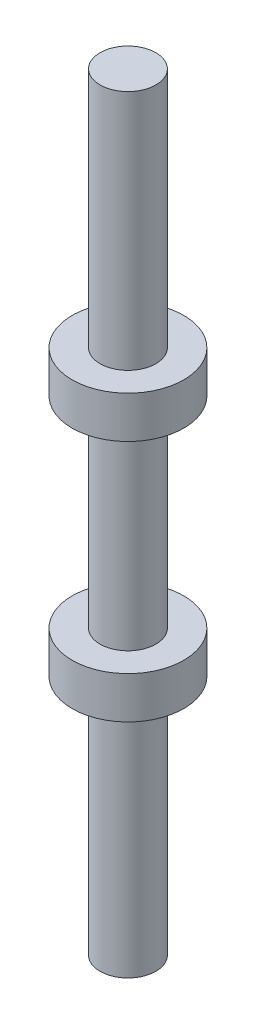
ISO-10303-21;
HEADER;
FILE_DESCRIPTION(('STEP AP214'),'2;1');
FILE_NAME('part.step','',(''),(''),'','','');
FILE_SCHEMA(('AUTOMOTIVE_DESIGN { 1 0 10303 214 1 1 1 1 }'));
ENDSEC;
DATA;
#1=APPLICATION_CONTEXT('core data for automotive mechanical design processes');
#2=APPLICATION_PROTOCOL_DEFINITION('international standard','automotive_design',2000,#1);
#3=PRODUCT_CONTEXT('',#1,'mechanical');
#4=PRODUCT('Part','Part','',(#3));
#5=PRODUCT_RELATED_PRODUCT_CATEGORY('part','',(#4));
#6=PRODUCT_DEFINITION_FORMATION('','',#4);
#7=PRODUCT_DEFINITION_CONTEXT('part definition',#1,'design');
#8=PRODUCT_DEFINITION('design','',#6,#7);
#9=PRODUCT_DEFINITION_SHAPE('','',#8);
#10=(LENGTH_UNIT() NAMED_UNIT(*) SI_UNIT(.MILLI.,.METRE.));
#11=(NAMED_UNIT(*) PLANE_ANGLE_UNIT() SI_UNIT($,.RADIAN.));
#12=(NAMED_UNIT(*) SI_UNIT($,.STERADIAN.) SOLID_ANGLE_UNIT());
#13=UNCERTAINTY_MEASURE_WITH_UNIT(LENGTH_MEASURE(1.E-05),#10,'distance_accuracy_value','');
#14=(GEOMETRIC_REPRESENTATION_CONTEXT(3) GLOBAL_UNCERTAINTY_ASSIGNED_CONTEXT((#13)) GLOBAL_UNIT_ASSIGNED_CONTEXT((#10,
#11,#12)) REPRESENTATION_CONTEXT('',''));
#15=CARTESIAN_POINT('',(0.,0.,0.));
#16=DIRECTION('',(0.,0.,1.));
#17=DIRECTION('',(1.,0.,0.));
#18=AXIS2_PLACEMENT_3D('',#15,#16,#17);
#19=CARTESIAN_POINT('',(0.,-110.,0.));
#20=DIRECTION('',(0.,1.,0.));
#21=DIRECTION('',(0.,0.,1.));
#22=AXIS2_PLACEMENT_3D('',#19,#20,#21);
#23=PLANE('',#22);
#24=CARTESIAN_POINT('',(0.,-110.,0.));
#25=DIRECTION('',(0.,1.,0.));
#26=DIRECTION('',(0.,0.,1.));
#27=AXIS2_PLACEMENT_3D('',#24,#25,#26);
#28=CIRCLE('',#27,4.);
#29=CARTESIAN_POINT('',(0.,-110.,4.));
#30=VERTEX_POINT('',#29);
#31=EDGE_CURVE('E26',#30,#30,#28,.F.);
#32=ORIENTED_EDGE('',*,*,#31,.T.);
#33=EDGE_LOOP('',(#32));
#34=FACE_BOUND('',#33,.T.);
#35=ADVANCED_FACE('F23',(#34),#23,.F.);
#36=CARTESIAN_POINT('',(0.,-110.,0.));
#37=DIRECTION('',(0.,1.,0.));
#38=DIRECTION('',(0.,0.,1.));
#39=AXIS2_PLACEMENT_3D('',#36,#37,#38);
#40=CYLINDRICAL_SURFACE('',#39,4.);
#41=ORIENTED_EDGE('',*,*,#31,.F.);
#42=EDGE_LOOP('',(#41));
#43=FACE_BOUND('',#42,.T.);
#44=CARTESIAN_POINT('',(0.,-75.4,0.));
#45=DIRECTION('',(0.,1.,0.));
#46=DIRECTION('',(0.,0.,1.));
#47=AXIS2_PLACEMENT_3D('',#44,#45,#46);
#48=CIRCLE('',#47,4.);
#49=CARTESIAN_POINT('',(0.,-75.4,4.));
#50=VERTEX_POINT('',#49);
#51=EDGE_CURVE('E54',#50,#50,#48,.F.);
#52=ORIENTED_EDGE('',*,*,#51,.T.);
#53=EDGE_LOOP('',(#52));
#54=FACE_BOUND('',#53,.T.);
#55=ADVANCED_FACE('F62',(#43,#54),#40,.T.);
#56=CARTESIAN_POINT('',(0.,-75.4,0.));
#57=DIRECTION('',(0.,1.,0.));
#58=DIRECTION('',(0.,0.,1.));
#59=AXIS2_PLACEMENT_3D('',#56,#57,#58);
#60=PLANE('',#59);
#61=ORIENTED_EDGE('',*,*,#51,.F.);
#62=EDGE_LOOP('',(#61));
#63=FACE_BOUND('',#62,.T.);
#64=CARTESIAN_POINT('',(0.,-75.4,0.));
#65=DIRECTION('',(0.,1.,0.));
#66=DIRECTION('',(0.,0.,1.));
#67=AXIS2_PLACEMENT_3D('',#64,#65,#66);
#68=CIRCLE('',#67,8.);
#69=CARTESIAN_POINT('',(0.,-75.4,8.));
#70=VERTEX_POINT('',#69);
#71=EDGE_CURVE('E52',#70,#70,#68,.F.);
#72=ORIENTED_EDGE('',*,*,#71,.T.);
#73=EDGE_LOOP('',(#72));
#74=FACE_BOUND('',#73,.T.);
#75=ADVANCED_FACE('F64',(#63,#74),#60,.F.);
#76=CARTESIAN_POINT('',(0.,-75.4,0.));
#77=DIRECTION('',(0.,1.,0.));
#78=DIRECTION('',(0.,0.,1.));
#79=AXIS2_PLACEMENT_3D('',#76,#77,#78);
#80=CYLINDRICAL_SURFACE('',#79,8.);
#81=ORIENTED_EDGE('',*,*,#71,.F.);
#82=EDGE_LOOP('',(#81));
#83=FACE_BOUND('',#82,.T.);
#84=CARTESIAN_POINT('',(0.,-69.4,0.));
#85=DIRECTION('',(0.,1.,0.));
#86=DIRECTION('',(0.,0.,1.));
#87=AXIS2_PLACEMENT_3D('',#84,#85,#86);
#88=CIRCLE('',#87,8.);
#89=CARTESIAN_POINT('',(0.,-69.4,8.00000000000001));
#90=VERTEX_POINT('',#89);
#91=EDGE_CURVE('E49',#90,#90,#88,.F.);
#92=ORIENTED_EDGE('',*,*,#91,.T.);
#93=EDGE_LOOP('',(#92));
#94=FACE_BOUND('',#93,.T.);
#95=ADVANCED_FACE('F70',(#83,#94),#80,.T.);
#96=CARTESIAN_POINT('',(0.,-69.4,0.));
#97=DIRECTION('',(0.,1.,0.));
#98=DIRECTION('',(0.,0.,1.));
#99=AXIS2_PLACEMENT_3D('',#96,#97,#98);
#100=PLANE('',#99);
#101=CARTESIAN_POINT('',(0.,-69.4,0.));
#102=DIRECTION('',(0.,1.,0.));
#103=DIRECTION('',(0.,0.,1.));
#104=AXIS2_PLACEMENT_3D('',#101,#102,#103);
#105=CIRCLE('',#104,4.);
#106=CARTESIAN_POINT('',(0.,-69.4,4.));
#107=VERTEX_POINT('',#106);
#108=EDGE_CURVE('E46',#107,#107,#105,.F.);
#109=ORIENTED_EDGE('',*,*,#108,.T.);
#110=EDGE_LOOP('',(#109));
#111=FACE_BOUND('',#110,.T.);
#112=ORIENTED_EDGE('',*,*,#91,.F.);
#113=EDGE_LOOP('',(#112));
#114=FACE_BOUND('',#113,.T.);
#115=ADVANCED_FACE('F98',(#111,#114),#100,.T.);
#116=CARTESIAN_POINT('',(0.,-69.4,0.));
#117=DIRECTION('',(0.,1.,0.));
#118=DIRECTION('',(0.,0.,1.));
#119=AXIS2_PLACEMENT_3D('',#116,#117,#118);
#120=CYLINDRICAL_SURFACE('',#119,4.);
#121=CARTESIAN_POINT('',(0.,-40.6,0.));
#122=DIRECTION('',(0.,1.,0.));
#123=DIRECTION('',(0.,0.,1.));
#124=AXIS2_PLACEMENT_3D('',#121,#122,#123);
#125=CIRCLE('',#124,4.);
#126=CARTESIAN_POINT('',(0.,-40.6,4.00000000000005));
#127=VERTEX_POINT('',#126);
#128=EDGE_CURVE('E43',#127,#127,#125,.F.);
#129=ORIENTED_EDGE('',*,*,#128,.T.);
#130=EDGE_LOOP('',(#129));
#131=FACE_BOUND('',#130,.T.);
#132=ORIENTED_EDGE('',*,*,#108,.F.);
#133=EDGE_LOOP('',(#132));
#134=FACE_BOUND('',#133,.T.);
#135=ADVANCED_FACE('F94',(#131,#134),#120,.T.);
#136=CARTESIAN_POINT('',(0.,-40.6,0.));
#137=DIRECTION('',(0.,1.,0.));
#138=DIRECTION('',(0.,0.,1.));
#139=AXIS2_PLACEMENT_3D('',#136,#137,#138);
#140=PLANE('',#139);
#141=ORIENTED_EDGE('',*,*,#128,.F.);
#142=EDGE_LOOP('',(#141));
#143=FACE_BOUND('',#142,.T.);
#144=CARTESIAN_POINT('',(0.,-40.6,0.));
#145=DIRECTION('',(0.,1.,0.));
#146=DIRECTION('',(0.,0.,1.));
#147=AXIS2_PLACEMENT_3D('',#144,#145,#146);
#148=CIRCLE('',#147,8.);
#149=CARTESIAN_POINT('',(0.,-40.6,8.));
#150=VERTEX_POINT('',#149);
#151=EDGE_CURVE('E40',#150,#150,#148,.F.);
#152=ORIENTED_EDGE('',*,*,#151,.T.);
#153=EDGE_LOOP('',(#152));
#154=FACE_BOUND('',#153,.T.);
#155=ADVANCED_FACE('F90',(#143,#154),#140,.F.);
#156=CARTESIAN_POINT('',(0.,-40.6,0.));
#157=DIRECTION('',(0.,1.,0.));
#158=DIRECTION('',(0.,0.,1.));
#159=AXIS2_PLACEMENT_3D('',#156,#157,#158);
#160=CYLINDRICAL_SURFACE('',#159,8.);
#161=CARTESIAN_POINT('',(0.,-34.6,0.));
#162=DIRECTION('',(0.,1.,0.));
#163=DIRECTION('',(0.,0.,1.));
#164=AXIS2_PLACEMENT_3D('',#161,#162,#163);
#165=CIRCLE('',#164,8.);
#166=CARTESIAN_POINT('',(0.,-34.6,8.));
#167=VERTEX_POINT('',#166);
#168=EDGE_CURVE('E35',#167,#167,#165,.F.);
#169=ORIENTED_EDGE('',*,*,#168,.T.);
#170=EDGE_LOOP('',(#169));
#171=FACE_BOUND('',#170,.T.);
#172=ORIENTED_EDGE('',*,*,#151,.F.);
#173=EDGE_LOOP('',(#172));
#174=FACE_BOUND('',#173,.T.);
#175=ADVANCED_FACE('F86',(#171,#174),#160,.T.);
#176=CARTESIAN_POINT('',(0.,-34.6,0.));
#177=DIRECTION('',(0.,1.,0.));
#178=DIRECTION('',(0.,0.,1.));
#179=AXIS2_PLACEMENT_3D('',#176,#177,#178);
#180=PLANE('',#179);
#181=CARTESIAN_POINT('',(0.,-34.6,0.));
#182=DIRECTION('',(0.,1.,0.));
#183=DIRECTION('',(0.,0.,1.));
#184=AXIS2_PLACEMENT_3D('',#181,#182,#183);
#185=CIRCLE('',#184,4.);
#186=CARTESIAN_POINT('',(0.,-34.6,4.));
#187=VERTEX_POINT('',#186);
#188=EDGE_CURVE('E30',#187,#187,#185,.F.);
#189=ORIENTED_EDGE('',*,*,#188,.T.);
#190=EDGE_LOOP('',(#189));
#191=FACE_BOUND('',#190,.T.);
#192=ORIENTED_EDGE('',*,*,#168,.F.);
#193=EDGE_LOOP('',(#192));
#194=FACE_BOUND('',#193,.T.);
#195=ADVANCED_FACE('F81',(#191,#194),#180,.T.);
#196=CARTESIAN_POINT('',(0.,-34.6,0.));
#197=DIRECTION('',(0.,1.,0.));
#198=DIRECTION('',(0.,0.,1.));
#199=AXIS2_PLACEMENT_3D('',#196,#197,#198);
#200=CYLINDRICAL_SURFACE('',#199,4.);
#201=CARTESIAN_POINT('',(0.,0.,0.));
#202=DIRECTION('',(0.,1.,0.));
#203=DIRECTION('',(0.,0.,1.));
#204=AXIS2_PLACEMENT_3D('',#201,#202,#203);
#205=CIRCLE('',#204,4.);
#206=CARTESIAN_POINT('',(0.,0.,4.));
#207=VERTEX_POINT('',#206);
#208=EDGE_CURVE('E12',#207,#207,#205,.F.);
#209=ORIENTED_EDGE('',*,*,#208,.T.);
#210=EDGE_LOOP('',(#209));
#211=FACE_BOUND('',#210,.T.);
#212=ORIENTED_EDGE('',*,*,#188,.F.);
#213=EDGE_LOOP('',(#212));
#214=FACE_BOUND('',#213,.T.);
#215=ADVANCED_FACE('F75',(#211,#214),#200,.T.);
#216=CARTESIAN_POINT('',(0.,0.,0.));
#217=DIRECTION('',(0.,1.,0.));
#218=DIRECTION('',(0.,0.,1.));
#219=AXIS2_PLACEMENT_3D('',#216,#217,#218);
#220=PLANE('',#219);
#221=ORIENTED_EDGE('',*,*,#208,.F.);
#222=EDGE_LOOP('',(#221));
#223=FACE_BOUND('',#222,.T.);
#224=ADVANCED_FACE('F73',(#223),#220,.T.);
#225=CLOSED_SHELL('',(#35,#55,#75,#95,#115,#135,#155,#175,#195,#215,#224));
#226=MANIFOLD_SOLID_BREP('B1',#225);
#227=ADVANCED_BREP_SHAPE_REPRESENTATION('',(#18,#226),#14);
#228=SHAPE_DEFINITION_REPRESENTATION(#9,#227);
ENDSEC;
END-ISO-10303-21;
